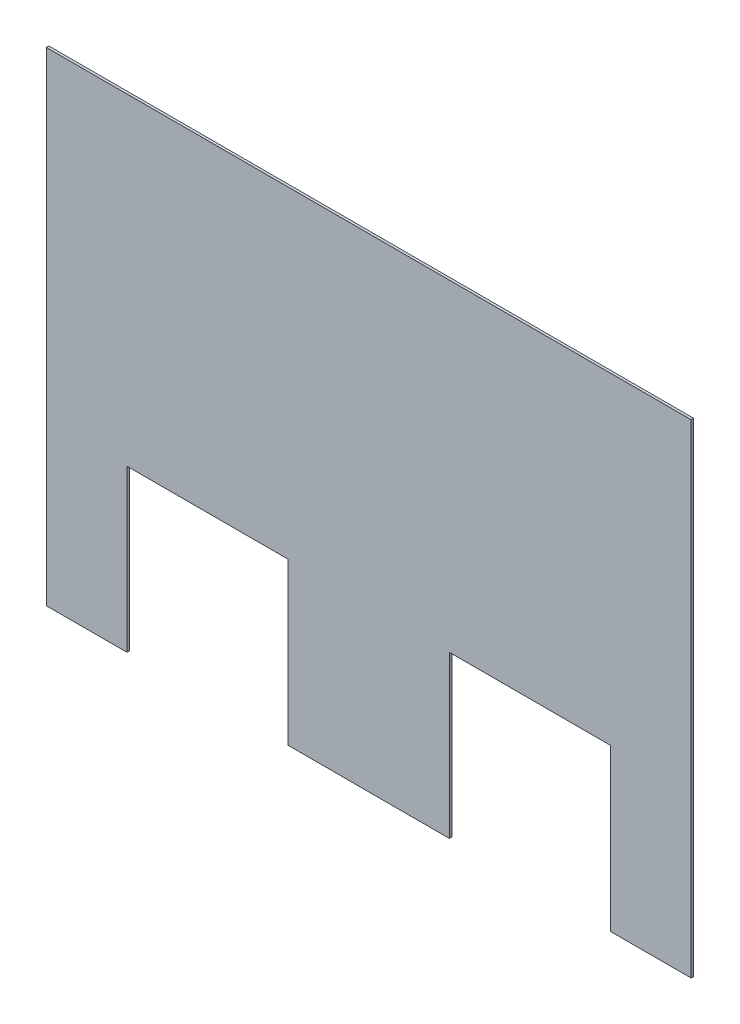
ISO-10303-21;
HEADER;
FILE_DESCRIPTION(('STEP AP214'),'2;1');
FILE_NAME('part.step','',(''),(''),'','','');
FILE_SCHEMA(('AUTOMOTIVE_DESIGN { 1 0 10303 214 1 1 1 1 }'));
ENDSEC;
DATA;
#1=APPLICATION_CONTEXT('core data for automotive mechanical design processes');
#2=APPLICATION_PROTOCOL_DEFINITION('international standard','automotive_design',2000,#1);
#3=PRODUCT_CONTEXT('',#1,'mechanical');
#4=PRODUCT('Part','Part','',(#3));
#5=PRODUCT_RELATED_PRODUCT_CATEGORY('part','',(#4));
#6=PRODUCT_DEFINITION_FORMATION('','',#4);
#7=PRODUCT_DEFINITION_CONTEXT('part definition',#1,'design');
#8=PRODUCT_DEFINITION('design','',#6,#7);
#9=PRODUCT_DEFINITION_SHAPE('','',#8);
#10=(LENGTH_UNIT() NAMED_UNIT(*) SI_UNIT(.MILLI.,.METRE.));
#11=(NAMED_UNIT(*) PLANE_ANGLE_UNIT() SI_UNIT($,.RADIAN.));
#12=(NAMED_UNIT(*) SI_UNIT($,.STERADIAN.) SOLID_ANGLE_UNIT());
#13=UNCERTAINTY_MEASURE_WITH_UNIT(LENGTH_MEASURE(1.E-05),#10,'distance_accuracy_value','');
#14=(GEOMETRIC_REPRESENTATION_CONTEXT(3) GLOBAL_UNCERTAINTY_ASSIGNED_CONTEXT((#13)) GLOBAL_UNIT_ASSIGNED_CONTEXT((#10,
#11,#12)) REPRESENTATION_CONTEXT('',''));
#15=CARTESIAN_POINT('',(0.,0.,0.));
#16=DIRECTION('',(0.,0.,1.));
#17=DIRECTION('',(1.,0.,0.));
#18=AXIS2_PLACEMENT_3D('',#15,#16,#17);
#19=CARTESIAN_POINT('',(0.,0.,2.38125));
#20=DIRECTION('',(0.,0.,1.));
#21=DIRECTION('',(1.,0.,0.));
#22=AXIS2_PLACEMENT_3D('',#19,#20,#21);
#23=PLANE('',#22);
#24=DIRECTION('',(1.,0.,0.));
#25=VECTOR('',#24,1.);
#26=CARTESIAN_POINT('',(-152.4,-152.4,2.38125));
#27=LINE('',#26,#25);
#28=CARTESIAN_POINT('',(-457.2,-152.4,2.38125));
#29=VERTEX_POINT('',#28);
#30=CARTESIAN_POINT('',(-152.4,-152.4,2.38125));
#31=VERTEX_POINT('',#30);
#32=EDGE_CURVE('E114',#29,#31,#27,.T.);
#33=ORIENTED_EDGE('',*,*,#32,.T.);
#34=DIRECTION('',(0.,1.,0.));
#35=VECTOR('',#34,1.);
#36=CARTESIAN_POINT('',(-152.4,-457.2,2.38125));
#37=LINE('',#36,#35);
#38=CARTESIAN_POINT('',(-152.4,-457.2,2.38125));
#39=VERTEX_POINT('',#38);
#40=EDGE_CURVE('E20',#31,#39,#37,.F.);
#41=ORIENTED_EDGE('',*,*,#40,.T.);
#42=DIRECTION('',(1.,0.,0.));
#43=VECTOR('',#42,1.);
#44=CARTESIAN_POINT('',(-609.6,-457.2,2.38125));
#45=LINE('',#44,#43);
#46=CARTESIAN_POINT('',(152.4,-457.2,2.38125));
#47=VERTEX_POINT('',#46);
#48=EDGE_CURVE('E103',#47,#39,#45,.F.);
#49=ORIENTED_EDGE('',*,*,#48,.F.);
#50=DIRECTION('',(0.,1.,0.));
#51=VECTOR('',#50,1.);
#52=CARTESIAN_POINT('',(152.4,-152.4,2.38125));
#53=LINE('',#52,#51);
#54=CARTESIAN_POINT('',(152.4,-152.4,2.38125));
#55=VERTEX_POINT('',#54);
#56=EDGE_CURVE('E122',#47,#55,#53,.T.);
#57=ORIENTED_EDGE('',*,*,#56,.T.);
#58=DIRECTION('',(1.,0.,0.));
#59=VECTOR('',#58,1.);
#60=CARTESIAN_POINT('',(457.2,-152.4,2.38125));
#61=LINE('',#60,#59);
#62=CARTESIAN_POINT('',(457.2,-152.4,2.38125));
#63=VERTEX_POINT('',#62);
#64=EDGE_CURVE('E129',#55,#63,#61,.T.);
#65=ORIENTED_EDGE('',*,*,#64,.T.);
#66=DIRECTION('',(0.,1.,0.));
#67=VECTOR('',#66,1.);
#68=CARTESIAN_POINT('',(457.2,-457.2,2.38125));
#69=LINE('',#68,#67);
#70=CARTESIAN_POINT('',(457.2,-457.2,2.38125));
#71=VERTEX_POINT('',#70);
#72=EDGE_CURVE('E134',#63,#71,#69,.F.);
#73=ORIENTED_EDGE('',*,*,#72,.T.);
#74=DIRECTION('',(1.,0.,0.));
#75=VECTOR('',#74,1.);
#76=CARTESIAN_POINT('',(-609.6,-457.2,2.38125));
#77=LINE('',#76,#75);
#78=CARTESIAN_POINT('',(609.6,-457.2,2.38125));
#79=VERTEX_POINT('',#78);
#80=EDGE_CURVE('E137',#79,#71,#77,.F.);
#81=ORIENTED_EDGE('',*,*,#80,.F.);
#82=DIRECTION('',(0.,1.,0.));
#83=VECTOR('',#82,1.);
#84=CARTESIAN_POINT('',(609.6,-457.2,2.38125));
#85=LINE('',#84,#83);
#86=CARTESIAN_POINT('',(609.6,457.2,2.38125));
#87=VERTEX_POINT('',#86);
#88=EDGE_CURVE('E141',#87,#79,#85,.F.);
#89=ORIENTED_EDGE('',*,*,#88,.F.);
#90=DIRECTION('',(1.,0.,0.));
#91=VECTOR('',#90,1.);
#92=CARTESIAN_POINT('',(609.6,457.2,2.38125));
#93=LINE('',#92,#91);
#94=CARTESIAN_POINT('',(-609.6,457.2,2.38125));
#95=VERTEX_POINT('',#94);
#96=EDGE_CURVE('E145',#95,#87,#93,.T.);
#97=ORIENTED_EDGE('',*,*,#96,.F.);
#98=DIRECTION('',(0.,1.,0.));
#99=VECTOR('',#98,1.);
#100=CARTESIAN_POINT('',(-609.6,457.2,2.38125));
#101=LINE('',#100,#99);
#102=CARTESIAN_POINT('',(-609.6,-457.2,2.38125));
#103=VERTEX_POINT('',#102);
#104=EDGE_CURVE('E149',#103,#95,#101,.T.);
#105=ORIENTED_EDGE('',*,*,#104,.F.);
#106=DIRECTION('',(1.,0.,0.));
#107=VECTOR('',#106,1.);
#108=CARTESIAN_POINT('',(-609.6,-457.2,2.38125));
#109=LINE('',#108,#107);
#110=CARTESIAN_POINT('',(-457.2,-457.2,2.38125));
#111=VERTEX_POINT('',#110);
#112=EDGE_CURVE('E153',#111,#103,#109,.F.);
#113=ORIENTED_EDGE('',*,*,#112,.F.);
#114=DIRECTION('',(0.,1.,0.));
#115=VECTOR('',#114,1.);
#116=CARTESIAN_POINT('',(-457.2,-152.4,2.38125));
#117=LINE('',#116,#115);
#118=EDGE_CURVE('E160',#111,#29,#117,.T.);
#119=ORIENTED_EDGE('',*,*,#118,.T.);
#120=EDGE_LOOP('',(#33,#41,#49,#57,#65,#73,#81,#89,#97,#105,#113,#119));
#121=FACE_BOUND('',#120,.T.);
#122=ADVANCED_FACE('F17',(#121),#23,.T.);
#123=CARTESIAN_POINT('',(-152.4,-457.2,2.38125));
#124=DIRECTION('',(1.,0.,0.));
#125=DIRECTION('',(0.,0.,-1.));
#126=AXIS2_PLACEMENT_3D('',#123,#124,#125);
#127=PLANE('',#126);
#128=ORIENTED_EDGE('',*,*,#40,.F.);
#129=DIRECTION('',(0.,0.,1.));
#130=VECTOR('',#129,1.);
#131=CARTESIAN_POINT('',(-152.4,-152.4,2.38125));
#132=LINE('',#131,#130);
#133=CARTESIAN_POINT('',(-152.4,-152.4,-2.38125));
#134=VERTEX_POINT('',#133);
#135=EDGE_CURVE('E164',#31,#134,#132,.F.);
#136=ORIENTED_EDGE('',*,*,#135,.T.);
#137=DIRECTION('',(0.,1.,0.));
#138=VECTOR('',#137,1.);
#139=CARTESIAN_POINT('',(-152.4,0.,-2.38125));
#140=LINE('',#139,#138);
#141=CARTESIAN_POINT('',(-152.4,-457.2,-2.38125));
#142=VERTEX_POINT('',#141);
#143=EDGE_CURVE('E120',#134,#142,#140,.F.);
#144=ORIENTED_EDGE('',*,*,#143,.T.);
#145=DIRECTION('',(0.,0.,-1.));
#146=VECTOR('',#145,1.);
#147=CARTESIAN_POINT('',(-152.4,-457.2,-2.38125));
#148=LINE('',#147,#146);
#149=EDGE_CURVE('E110',#39,#142,#148,.T.);
#150=ORIENTED_EDGE('',*,*,#149,.F.);
#151=EDGE_LOOP('',(#128,#136,#144,#150));
#152=FACE_BOUND('',#151,.T.);
#153=ADVANCED_FACE('F119',(#152),#127,.F.);
#154=CARTESIAN_POINT('',(-609.6,-457.2,-2.38125));
#155=DIRECTION('',(0.,-1.,0.));
#156=DIRECTION('',(0.,0.,-1.));
#157=AXIS2_PLACEMENT_3D('',#154,#155,#156);
#158=PLANE('',#157);
#159=ORIENTED_EDGE('',*,*,#48,.T.);
#160=ORIENTED_EDGE('',*,*,#149,.T.);
#161=DIRECTION('',(1.,0.,0.));
#162=VECTOR('',#161,1.);
#163=CARTESIAN_POINT('',(0.,-457.2,-2.38125));
#164=LINE('',#163,#162);
#165=CARTESIAN_POINT('',(152.4,-457.2,-2.38125));
#166=VERTEX_POINT('',#165);
#167=EDGE_CURVE('E167',#142,#166,#164,.T.);
#168=ORIENTED_EDGE('',*,*,#167,.T.);
#169=DIRECTION('',(0.,0.,1.));
#170=VECTOR('',#169,1.);
#171=CARTESIAN_POINT('',(152.4,-457.2,2.38125));
#172=LINE('',#171,#170);
#173=EDGE_CURVE('E112',#166,#47,#172,.T.);
#174=ORIENTED_EDGE('',*,*,#173,.T.);
#175=EDGE_LOOP('',(#159,#160,#168,#174));
#176=FACE_BOUND('',#175,.T.);
#177=ADVANCED_FACE('F107',(#176),#158,.T.);
#178=CARTESIAN_POINT('',(152.4,-152.4,2.38125));
#179=DIRECTION('',(-1.,0.,0.));
#180=DIRECTION('',(0.,0.,1.));
#181=AXIS2_PLACEMENT_3D('',#178,#179,#180);
#182=PLANE('',#181);
#183=ORIENTED_EDGE('',*,*,#56,.F.);
#184=ORIENTED_EDGE('',*,*,#173,.F.);
#185=DIRECTION('',(0.,1.,0.));
#186=VECTOR('',#185,1.);
#187=CARTESIAN_POINT('',(152.4,0.,-2.38125));
#188=LINE('',#187,#186);
#189=CARTESIAN_POINT('',(152.4,-152.4,-2.38125));
#190=VERTEX_POINT('',#189);
#191=EDGE_CURVE('E169',#166,#190,#188,.T.);
#192=ORIENTED_EDGE('',*,*,#191,.T.);
#193=DIRECTION('',(0.,0.,1.));
#194=VECTOR('',#193,1.);
#195=CARTESIAN_POINT('',(152.4,-152.4,2.38125));
#196=LINE('',#195,#194);
#197=EDGE_CURVE('E126',#190,#55,#196,.T.);
#198=ORIENTED_EDGE('',*,*,#197,.T.);
#199=EDGE_LOOP('',(#183,#184,#192,#198));
#200=FACE_BOUND('',#199,.T.);
#201=ADVANCED_FACE('F234',(#200),#182,.F.);
#202=CARTESIAN_POINT('',(457.2,-152.4,2.38125));
#203=DIRECTION('',(0.,1.,0.));
#204=DIRECTION('',(0.,0.,1.));
#205=AXIS2_PLACEMENT_3D('',#202,#203,#204);
#206=PLANE('',#205);
#207=ORIENTED_EDGE('',*,*,#64,.F.);
#208=ORIENTED_EDGE('',*,*,#197,.F.);
#209=DIRECTION('',(1.,0.,0.));
#210=VECTOR('',#209,1.);
#211=CARTESIAN_POINT('',(0.,-152.4,-2.38125));
#212=LINE('',#211,#210);
#213=CARTESIAN_POINT('',(457.2,-152.4,-2.38125));
#214=VERTEX_POINT('',#213);
#215=EDGE_CURVE('E172',#190,#214,#212,.T.);
#216=ORIENTED_EDGE('',*,*,#215,.T.);
#217=DIRECTION('',(0.,0.,-1.));
#218=VECTOR('',#217,1.);
#219=CARTESIAN_POINT('',(457.2,-152.4,2.38125));
#220=LINE('',#219,#218);
#221=EDGE_CURVE('E131',#214,#63,#220,.F.);
#222=ORIENTED_EDGE('',*,*,#221,.T.);
#223=EDGE_LOOP('',(#207,#208,#216,#222));
#224=FACE_BOUND('',#223,.T.);
#225=ADVANCED_FACE('F232',(#224),#206,.F.);
#226=CARTESIAN_POINT('',(457.2,-457.2,2.38125));
#227=DIRECTION('',(1.,0.,0.));
#228=DIRECTION('',(0.,0.,-1.));
#229=AXIS2_PLACEMENT_3D('',#226,#227,#228);
#230=PLANE('',#229);
#231=ORIENTED_EDGE('',*,*,#72,.F.);
#232=ORIENTED_EDGE('',*,*,#221,.F.);
#233=DIRECTION('',(0.,1.,0.));
#234=VECTOR('',#233,1.);
#235=CARTESIAN_POINT('',(457.2,0.,-2.38125));
#236=LINE('',#235,#234);
#237=CARTESIAN_POINT('',(457.2,-457.2,-2.38125));
#238=VERTEX_POINT('',#237);
#239=EDGE_CURVE('E175',#214,#238,#236,.F.);
#240=ORIENTED_EDGE('',*,*,#239,.T.);
#241=DIRECTION('',(0.,0.,-1.));
#242=VECTOR('',#241,1.);
#243=CARTESIAN_POINT('',(457.2,-457.2,-2.38125));
#244=LINE('',#243,#242);
#245=EDGE_CURVE('E139',#71,#238,#244,.T.);
#246=ORIENTED_EDGE('',*,*,#245,.F.);
#247=EDGE_LOOP('',(#231,#232,#240,#246));
#248=FACE_BOUND('',#247,.T.);
#249=ADVANCED_FACE('F227',(#248),#230,.F.);
#250=CARTESIAN_POINT('',(-609.6,-457.2,-2.38125));
#251=DIRECTION('',(0.,-1.,0.));
#252=DIRECTION('',(0.,0.,-1.));
#253=AXIS2_PLACEMENT_3D('',#250,#251,#252);
#254=PLANE('',#253);
#255=ORIENTED_EDGE('',*,*,#80,.T.);
#256=ORIENTED_EDGE('',*,*,#245,.T.);
#257=DIRECTION('',(1.,0.,0.));
#258=VECTOR('',#257,1.);
#259=CARTESIAN_POINT('',(0.,-457.2,-2.38125));
#260=LINE('',#259,#258);
#261=CARTESIAN_POINT('',(609.6,-457.2,-2.38125));
#262=VERTEX_POINT('',#261);
#263=EDGE_CURVE('E178',#238,#262,#260,.T.);
#264=ORIENTED_EDGE('',*,*,#263,.T.);
#265=DIRECTION('',(0.,0.,-1.));
#266=VECTOR('',#265,1.);
#267=CARTESIAN_POINT('',(609.6,-457.2,-2.38125));
#268=LINE('',#267,#266);
#269=EDGE_CURVE('E143',#79,#262,#268,.T.);
#270=ORIENTED_EDGE('',*,*,#269,.F.);
#271=EDGE_LOOP('',(#255,#256,#264,#270));
#272=FACE_BOUND('',#271,.T.);
#273=ADVANCED_FACE('F223',(#272),#254,.T.);
#274=CARTESIAN_POINT('',(609.6,-457.2,-2.38125));
#275=DIRECTION('',(1.,0.,0.));
#276=DIRECTION('',(0.,0.,-1.));
#277=AXIS2_PLACEMENT_3D('',#274,#275,#276);
#278=PLANE('',#277);
#279=ORIENTED_EDGE('',*,*,#269,.T.);
#280=DIRECTION('',(0.,1.,0.));
#281=VECTOR('',#280,1.);
#282=CARTESIAN_POINT('',(609.6,0.,-2.38125));
#283=LINE('',#282,#281);
#284=CARTESIAN_POINT('',(609.6,457.2,-2.38125));
#285=VERTEX_POINT('',#284);
#286=EDGE_CURVE('E181',#262,#285,#283,.T.);
#287=ORIENTED_EDGE('',*,*,#286,.T.);
#288=DIRECTION('',(0.,0.,1.));
#289=VECTOR('',#288,1.);
#290=CARTESIAN_POINT('',(609.6,457.2,-2.38125));
#291=LINE('',#290,#289);
#292=EDGE_CURVE('E147',#87,#285,#291,.F.);
#293=ORIENTED_EDGE('',*,*,#292,.F.);
#294=ORIENTED_EDGE('',*,*,#88,.T.);
#295=EDGE_LOOP('',(#279,#287,#293,#294));
#296=FACE_BOUND('',#295,.T.);
#297=ADVANCED_FACE('F217',(#296),#278,.T.);
#298=CARTESIAN_POINT('',(609.6,457.2,-2.38125));
#299=DIRECTION('',(0.,1.,0.));
#300=DIRECTION('',(0.,0.,1.));
#301=AXIS2_PLACEMENT_3D('',#298,#299,#300);
#302=PLANE('',#301);
#303=ORIENTED_EDGE('',*,*,#292,.T.);
#304=DIRECTION('',(1.,0.,0.));
#305=VECTOR('',#304,1.);
#306=CARTESIAN_POINT('',(0.,457.2,-2.38125));
#307=LINE('',#306,#305);
#308=CARTESIAN_POINT('',(-609.6,457.2,-2.38125));
#309=VERTEX_POINT('',#308);
#310=EDGE_CURVE('E184',#285,#309,#307,.F.);
#311=ORIENTED_EDGE('',*,*,#310,.T.);
#312=DIRECTION('',(0.,0.,1.));
#313=VECTOR('',#312,1.);
#314=CARTESIAN_POINT('',(-609.6,457.2,-2.38125));
#315=LINE('',#314,#313);
#316=EDGE_CURVE('E151',#95,#309,#315,.F.);
#317=ORIENTED_EDGE('',*,*,#316,.F.);
#318=ORIENTED_EDGE('',*,*,#96,.T.);
#319=EDGE_LOOP('',(#303,#311,#317,#318));
#320=FACE_BOUND('',#319,.T.);
#321=ADVANCED_FACE('F213',(#320),#302,.T.);
#322=CARTESIAN_POINT('',(-609.6,457.2,-2.38125));
#323=DIRECTION('',(-1.,0.,0.));
#324=DIRECTION('',(0.,0.,1.));
#325=AXIS2_PLACEMENT_3D('',#322,#323,#324);
#326=PLANE('',#325);
#327=ORIENTED_EDGE('',*,*,#316,.T.);
#328=DIRECTION('',(0.,1.,0.));
#329=VECTOR('',#328,1.);
#330=CARTESIAN_POINT('',(-609.6,0.,-2.38125));
#331=LINE('',#330,#329);
#332=CARTESIAN_POINT('',(-609.6,-457.2,-2.38125));
#333=VERTEX_POINT('',#332);
#334=EDGE_CURVE('E187',#309,#333,#331,.F.);
#335=ORIENTED_EDGE('',*,*,#334,.T.);
#336=DIRECTION('',(0.,0.,-1.));
#337=VECTOR('',#336,1.);
#338=CARTESIAN_POINT('',(-609.6,-457.2,-2.38125));
#339=LINE('',#338,#337);
#340=EDGE_CURVE('E155',#103,#333,#339,.T.);
#341=ORIENTED_EDGE('',*,*,#340,.F.);
#342=ORIENTED_EDGE('',*,*,#104,.T.);
#343=EDGE_LOOP('',(#327,#335,#341,#342));
#344=FACE_BOUND('',#343,.T.);
#345=ADVANCED_FACE('F207',(#344),#326,.T.);
#346=CARTESIAN_POINT('',(-609.6,-457.2,-2.38125));
#347=DIRECTION('',(0.,-1.,0.));
#348=DIRECTION('',(0.,0.,-1.));
#349=AXIS2_PLACEMENT_3D('',#346,#347,#348);
#350=PLANE('',#349);
#351=DIRECTION('',(1.,0.,0.));
#352=VECTOR('',#351,1.);
#353=CARTESIAN_POINT('',(0.,-457.2,-2.38125));
#354=LINE('',#353,#352);
#355=CARTESIAN_POINT('',(-457.2,-457.2,-2.38125));
#356=VERTEX_POINT('',#355);
#357=EDGE_CURVE('E190',#333,#356,#354,.T.);
#358=ORIENTED_EDGE('',*,*,#357,.T.);
#359=DIRECTION('',(0.,0.,1.));
#360=VECTOR('',#359,1.);
#361=CARTESIAN_POINT('',(-457.2,-457.2,2.38125));
#362=LINE('',#361,#360);
#363=EDGE_CURVE('E157',#356,#111,#362,.T.);
#364=ORIENTED_EDGE('',*,*,#363,.T.);
#365=ORIENTED_EDGE('',*,*,#112,.T.);
#366=ORIENTED_EDGE('',*,*,#340,.T.);
#367=EDGE_LOOP('',(#358,#364,#365,#366));
#368=FACE_BOUND('',#367,.T.);
#369=ADVANCED_FACE('F203',(#368),#350,.T.);
#370=CARTESIAN_POINT('',(-457.2,-152.4,2.38125));
#371=DIRECTION('',(-1.,0.,0.));
#372=DIRECTION('',(0.,0.,1.));
#373=AXIS2_PLACEMENT_3D('',#370,#371,#372);
#374=PLANE('',#373);
#375=ORIENTED_EDGE('',*,*,#118,.F.);
#376=ORIENTED_EDGE('',*,*,#363,.F.);
#377=DIRECTION('',(0.,1.,0.));
#378=VECTOR('',#377,1.);
#379=CARTESIAN_POINT('',(-457.2,0.,-2.38125));
#380=LINE('',#379,#378);
#381=CARTESIAN_POINT('',(-457.2,-152.4,-2.38125));
#382=VERTEX_POINT('',#381);
#383=EDGE_CURVE('E26',#356,#382,#380,.T.);
#384=ORIENTED_EDGE('',*,*,#383,.T.);
#385=DIRECTION('',(0.,0.,1.));
#386=VECTOR('',#385,1.);
#387=CARTESIAN_POINT('',(-457.2,-152.4,2.38125));
#388=LINE('',#387,#386);
#389=EDGE_CURVE('E34',#382,#29,#388,.T.);
#390=ORIENTED_EDGE('',*,*,#389,.T.);
#391=EDGE_LOOP('',(#375,#376,#384,#390));
#392=FACE_BOUND('',#391,.T.);
#393=ADVANCED_FACE('F197',(#392),#374,.F.);
#394=CARTESIAN_POINT('',(-152.4,-152.4,2.38125));
#395=DIRECTION('',(0.,1.,0.));
#396=DIRECTION('',(0.,0.,1.));
#397=AXIS2_PLACEMENT_3D('',#394,#395,#396);
#398=PLANE('',#397);
#399=ORIENTED_EDGE('',*,*,#32,.F.);
#400=ORIENTED_EDGE('',*,*,#389,.F.);
#401=DIRECTION('',(1.,0.,0.));
#402=VECTOR('',#401,1.);
#403=CARTESIAN_POINT('',(0.,-152.4,-2.38125));
#404=LINE('',#403,#402);
#405=EDGE_CURVE('E11',#382,#134,#404,.T.);
#406=ORIENTED_EDGE('',*,*,#405,.T.);
#407=ORIENTED_EDGE('',*,*,#135,.F.);
#408=EDGE_LOOP('',(#399,#400,#406,#407));
#409=FACE_BOUND('',#408,.T.);
#410=ADVANCED_FACE('F235',(#409),#398,.F.);
#411=CARTESIAN_POINT('',(0.,0.,-2.38125));
#412=DIRECTION('',(0.,0.,1.));
#413=DIRECTION('',(1.,0.,0.));
#414=AXIS2_PLACEMENT_3D('',#411,#412,#413);
#415=PLANE('',#414);
#416=ORIENTED_EDGE('',*,*,#383,.F.);
#417=ORIENTED_EDGE('',*,*,#357,.F.);
#418=ORIENTED_EDGE('',*,*,#334,.F.);
#419=ORIENTED_EDGE('',*,*,#310,.F.);
#420=ORIENTED_EDGE('',*,*,#286,.F.);
#421=ORIENTED_EDGE('',*,*,#263,.F.);
#422=ORIENTED_EDGE('',*,*,#239,.F.);
#423=ORIENTED_EDGE('',*,*,#215,.F.);
#424=ORIENTED_EDGE('',*,*,#191,.F.);
#425=ORIENTED_EDGE('',*,*,#167,.F.);
#426=ORIENTED_EDGE('',*,*,#143,.F.);
#427=ORIENTED_EDGE('',*,*,#405,.F.);
#428=EDGE_LOOP('',(#416,#417,#418,#419,#420,#421,#422,#423,#424,#425,#426,#427));
#429=FACE_BOUND('',#428,.T.);
#430=ADVANCED_FACE('F200',(#429),#415,.F.);
#431=CLOSED_SHELL('',(#122,#153,#177,#201,#225,#249,#273,#297,#321,#345,#369,#393,#410,#430));
#432=MANIFOLD_SOLID_BREP('B1',#431);
#433=ADVANCED_BREP_SHAPE_REPRESENTATION('',(#18,#432),#14);
#434=SHAPE_DEFINITION_REPRESENTATION(#9,#433);
ENDSEC;
END-ISO-10303-21;
